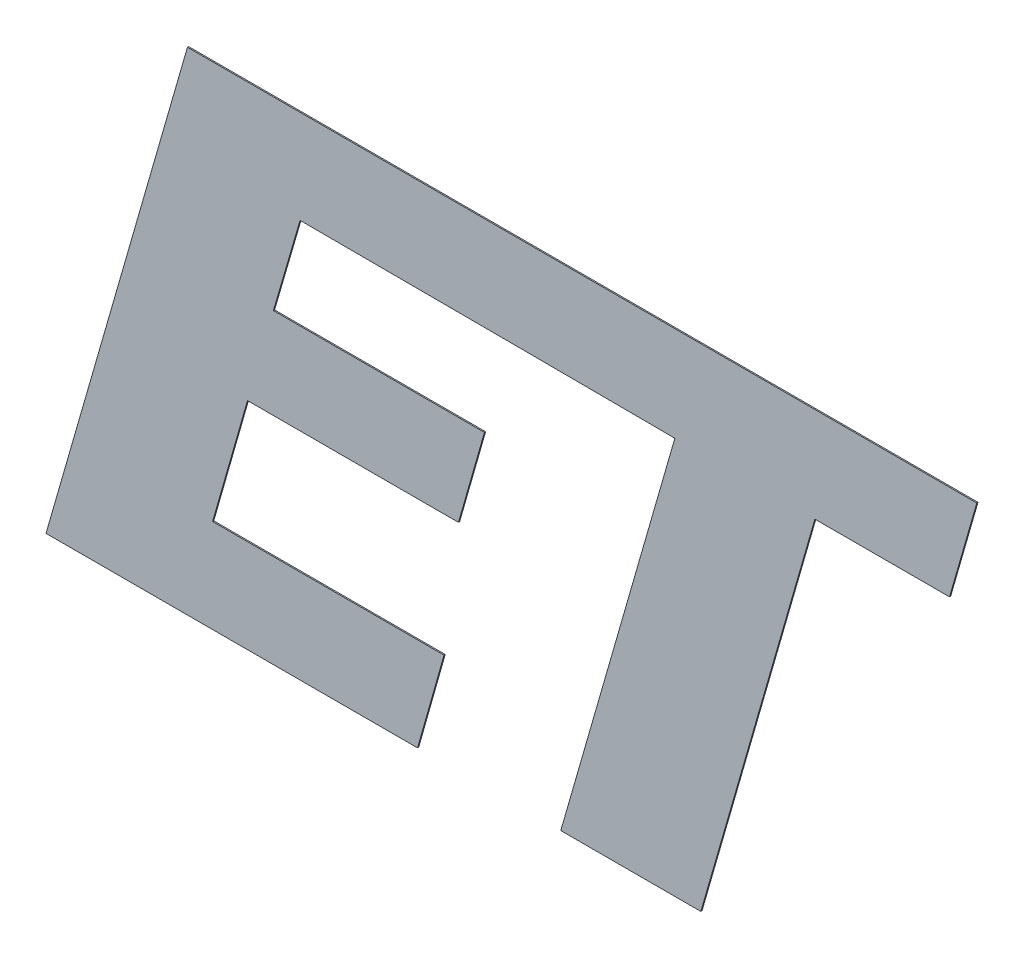
ISO-10303-21;
HEADER;
FILE_DESCRIPTION(('STEP AP214'),'2;1');
FILE_NAME('part.step','',(''),(''),'','','');
FILE_SCHEMA(('AUTOMOTIVE_DESIGN { 1 0 10303 214 1 1 1 1 }'));
ENDSEC;
DATA;
#1=APPLICATION_CONTEXT('core data for automotive mechanical design processes');
#2=APPLICATION_PROTOCOL_DEFINITION('international standard','automotive_design',2000,#1);
#3=PRODUCT_CONTEXT('',#1,'mechanical');
#4=PRODUCT('Part','Part','',(#3));
#5=PRODUCT_RELATED_PRODUCT_CATEGORY('part','',(#4));
#6=PRODUCT_DEFINITION_FORMATION('','',#4);
#7=PRODUCT_DEFINITION_CONTEXT('part definition',#1,'design');
#8=PRODUCT_DEFINITION('design','',#6,#7);
#9=PRODUCT_DEFINITION_SHAPE('','',#8);
#10=(LENGTH_UNIT() NAMED_UNIT(*) SI_UNIT(.MILLI.,.METRE.));
#11=(NAMED_UNIT(*) PLANE_ANGLE_UNIT() SI_UNIT($,.RADIAN.));
#12=(NAMED_UNIT(*) SI_UNIT($,.STERADIAN.) SOLID_ANGLE_UNIT());
#13=UNCERTAINTY_MEASURE_WITH_UNIT(LENGTH_MEASURE(1.E-05),#10,'distance_accuracy_value','');
#14=(GEOMETRIC_REPRESENTATION_CONTEXT(3) GLOBAL_UNCERTAINTY_ASSIGNED_CONTEXT((#13)) GLOBAL_UNIT_ASSIGNED_CONTEXT((#10,
#11,#12)) REPRESENTATION_CONTEXT('',''));
#15=CARTESIAN_POINT('',(0.,0.,0.));
#16=DIRECTION('',(0.,0.,1.));
#17=DIRECTION('',(1.,0.,0.));
#18=AXIS2_PLACEMENT_3D('',#15,#16,#17);
#19=CARTESIAN_POINT('',(11.563212908811,6.43585562533324,5.205));
#20=DIRECTION('',(0.00281330167602132,0.99999604265901,0.));
#21=DIRECTION('',(0.,0.,-1.));
#22=AXIS2_PLACEMENT_3D('',#19,#20,#21);
#23=PLANE('',#22);
#24=DIRECTION('',(0.99999604265901,-0.00281330167602132,0.));
#25=VECTOR('',#24,1.);
#26=CARTESIAN_POINT('',(11.563212908811,6.43585562533324,5.2));
#27=LINE('',#26,#25);
#28=CARTESIAN_POINT('',(11.563212908811,6.43585562533324,5.2));
#29=VERTEX_POINT('',#28);
#30=CARTESIAN_POINT('',(12.5025242320755,6.43321304875561,5.2));
#31=VERTEX_POINT('',#30);
#32=EDGE_CURVE('E10',#29,#31,#27,.T.);
#33=ORIENTED_EDGE('',*,*,#32,.T.);
#34=DIRECTION('',(0.,0.,-1.));
#35=VECTOR('',#34,1.);
#36=CARTESIAN_POINT('',(12.5025242320755,6.43321304875561,5.205));
#37=LINE('',#36,#35);
#38=CARTESIAN_POINT('',(12.5025242320755,6.43321304875561,5.205));
#39=VERTEX_POINT('',#38);
#40=EDGE_CURVE('E42',#39,#31,#37,.T.);
#41=ORIENTED_EDGE('',*,*,#40,.F.);
#42=DIRECTION('',(0.99999604265901,-0.00281330167602132,0.));
#43=VECTOR('',#42,1.);
#44=CARTESIAN_POINT('',(11.563212908811,6.43585562533324,5.205));
#45=LINE('',#44,#43);
#46=CARTESIAN_POINT('',(11.563212908811,6.43585562533324,5.205));
#47=VERTEX_POINT('',#46);
#48=EDGE_CURVE('E225',#47,#39,#45,.T.);
#49=ORIENTED_EDGE('',*,*,#48,.F.);
#50=DIRECTION('',(0.,0.,-1.));
#51=VECTOR('',#50,1.);
#52=CARTESIAN_POINT('',(11.563212908811,6.43585562533324,5.205));
#53=LINE('',#52,#51);
#54=EDGE_CURVE('E27',#47,#29,#53,.T.);
#55=ORIENTED_EDGE('',*,*,#54,.T.);
#56=EDGE_LOOP('',(#33,#41,#49,#55));
#57=FACE_BOUND('',#56,.T.);
#58=ADVANCED_FACE('F16',(#57),#23,.F.);
#59=CARTESIAN_POINT('',(12.5025242320755,6.43321304875561,5.205));
#60=DIRECTION('',(0.00465069382367867,0.999989185465002,0.));
#61=DIRECTION('',(0.,0.,-1.));
#62=AXIS2_PLACEMENT_3D('',#59,#60,#61);
#63=PLANE('',#62);
#64=DIRECTION('',(0.999989185465002,-0.00465069382367867,0.));
#65=VECTOR('',#64,1.);
#66=CARTESIAN_POINT('',(12.5025242320755,6.43321304875561,5.2));
#67=LINE('',#66,#65);
#68=CARTESIAN_POINT('',(13.1256737048785,6.43031494000952,5.2));
#69=VERTEX_POINT('',#68);
#70=EDGE_CURVE('E270',#31,#69,#67,.T.);
#71=ORIENTED_EDGE('',*,*,#70,.T.);
#72=DIRECTION('',(0.,0.,-1.));
#73=VECTOR('',#72,1.);
#74=CARTESIAN_POINT('',(13.1256737048785,6.43031494000952,5.205));
#75=LINE('',#74,#73);
#76=CARTESIAN_POINT('',(13.1256737048785,6.43031494000952,5.205));
#77=VERTEX_POINT('',#76);
#78=EDGE_CURVE('E236',#77,#69,#75,.T.);
#79=ORIENTED_EDGE('',*,*,#78,.F.);
#80=DIRECTION('',(0.999989185465002,-0.00465069382367867,0.));
#81=VECTOR('',#80,1.);
#82=CARTESIAN_POINT('',(12.5025242320755,6.43321304875561,5.205));
#83=LINE('',#82,#81);
#84=EDGE_CURVE('E222',#39,#77,#83,.T.);
#85=ORIENTED_EDGE('',*,*,#84,.F.);
#86=ORIENTED_EDGE('',*,*,#40,.T.);
#87=EDGE_LOOP('',(#71,#79,#85,#86));
#88=FACE_BOUND('',#87,.T.);
#89=ADVANCED_FACE('F543',(#88),#63,.F.);
#90=CARTESIAN_POINT('',(13.1256737048785,6.43031494000952,5.205));
#91=DIRECTION('',(0.961066454899901,-0.276317334356962,0.));
#92=DIRECTION('',(0.,0.,-1.));
#93=AXIS2_PLACEMENT_3D('',#90,#91,#92);
#94=PLANE('',#93);
#95=DIRECTION('',(-0.276317334356962,-0.961066454899901,0.));
#96=VECTOR('',#95,1.);
#97=CARTESIAN_POINT('',(13.1256737048785,6.43031494000952,5.2));
#98=LINE('',#97,#96);
#99=CARTESIAN_POINT('',(12.6501345708676,4.77632999999994,5.2));
#100=VERTEX_POINT('',#99);
#101=EDGE_CURVE('E240',#69,#100,#98,.T.);
#102=ORIENTED_EDGE('',*,*,#101,.T.);
#103=DIRECTION('',(0.,0.,-1.));
#104=VECTOR('',#103,1.);
#105=CARTESIAN_POINT('',(12.6501345708676,4.77632999999994,5.205));
#106=LINE('',#105,#104);
#107=CARTESIAN_POINT('',(12.6501345708676,4.77632999999994,5.205));
#108=VERTEX_POINT('',#107);
#109=EDGE_CURVE('E249',#108,#100,#106,.T.);
#110=ORIENTED_EDGE('',*,*,#109,.F.);
#111=DIRECTION('',(-0.276317334356962,-0.961066454899901,0.));
#112=VECTOR('',#111,1.);
#113=CARTESIAN_POINT('',(13.1256737048785,6.43031494000952,5.205));
#114=LINE('',#113,#112);
#115=EDGE_CURVE('E211',#77,#108,#114,.T.);
#116=ORIENTED_EDGE('',*,*,#115,.F.);
#117=ORIENTED_EDGE('',*,*,#78,.T.);
#118=EDGE_LOOP('',(#102,#110,#116,#117));
#119=FACE_BOUND('',#118,.T.);
#120=ADVANCED_FACE('F547',(#119),#94,.F.);
#121=CARTESIAN_POINT('',(12.6501345708676,4.77632999999994,5.205));
#122=DIRECTION('',(0.,1.,0.));
#123=DIRECTION('',(1.,0.,0.));
#124=AXIS2_PLACEMENT_3D('',#121,#122,#123);
#125=PLANE('',#124);
#126=DIRECTION('',(1.,0.,0.));
#127=VECTOR('',#126,1.);
#128=CARTESIAN_POINT('',(12.6501345708676,4.77632999999994,5.2));
#129=LINE('',#128,#127);
#130=CARTESIAN_POINT('',(13.2340318095169,4.77632999999994,5.2));
#131=VERTEX_POINT('',#130);
#132=EDGE_CURVE('E241',#100,#131,#129,.T.);
#133=ORIENTED_EDGE('',*,*,#132,.T.);
#134=DIRECTION('',(0.,0.,-1.));
#135=VECTOR('',#134,1.);
#136=CARTESIAN_POINT('',(13.2340318095169,4.77632999999994,5.205));
#137=LINE('',#136,#135);
#138=CARTESIAN_POINT('',(13.2340318095169,4.77632999999994,5.205));
#139=VERTEX_POINT('',#138);
#140=EDGE_CURVE('E254',#139,#131,#137,.T.);
#141=ORIENTED_EDGE('',*,*,#140,.F.);
#142=DIRECTION('',(1.,0.,0.));
#143=VECTOR('',#142,1.);
#144=CARTESIAN_POINT('',(12.6501345708676,4.77632999999994,5.205));
#145=LINE('',#144,#143);
#146=EDGE_CURVE('E208',#108,#139,#145,.T.);
#147=ORIENTED_EDGE('',*,*,#146,.F.);
#148=ORIENTED_EDGE('',*,*,#109,.T.);
#149=EDGE_LOOP('',(#133,#141,#147,#148));
#150=FACE_BOUND('',#149,.T.);
#151=ADVANCED_FACE('F550',(#150),#125,.F.);
#152=CARTESIAN_POINT('',(13.2340318095169,4.77632999999994,5.205));
#153=DIRECTION('',(-0.961087610217285,0.276243742891722,0.));
#154=DIRECTION('',(0.,0.,1.));
#155=AXIS2_PLACEMENT_3D('',#152,#153,#154);
#156=PLANE('',#155);
#157=DIRECTION('',(0.276243742891722,0.961087610217285,0.));
#158=VECTOR('',#157,1.);
#159=CARTESIAN_POINT('',(13.2340318095169,4.77632999999994,5.2));
#160=LINE('',#159,#158);
#161=CARTESIAN_POINT('',(13.7094338287044,6.43031494000443,5.2));
#162=VERTEX_POINT('',#161);
#163=EDGE_CURVE('E253',#131,#162,#160,.T.);
#164=ORIENTED_EDGE('',*,*,#163,.T.);
#165=DIRECTION('',(0.,0.,-1.));
#166=VECTOR('',#165,1.);
#167=CARTESIAN_POINT('',(13.7094338287044,6.43031494000443,5.205));
#168=LINE('',#167,#166);
#169=CARTESIAN_POINT('',(13.7094338287044,6.43031494000443,5.205));
#170=VERTEX_POINT('',#169);
#171=EDGE_CURVE('E231',#170,#162,#168,.T.);
#172=ORIENTED_EDGE('',*,*,#171,.F.);
#173=DIRECTION('',(0.276243742891722,0.961087610217285,0.));
#174=VECTOR('',#173,1.);
#175=CARTESIAN_POINT('',(13.2340318095169,4.77632999999994,5.205));
#176=LINE('',#175,#174);
#177=EDGE_CURVE('E212',#139,#170,#176,.T.);
#178=ORIENTED_EDGE('',*,*,#177,.F.);
#179=ORIENTED_EDGE('',*,*,#140,.T.);
#180=EDGE_LOOP('',(#164,#172,#178,#179));
#181=FACE_BOUND('',#180,.T.);
#182=ADVANCED_FACE('F556',(#181),#156,.F.);
#183=CARTESIAN_POINT('',(13.7094338287044,6.43031494000443,5.205));
#184=DIRECTION('',(7.938847109814E-05,0.999999996848735,0.));
#185=DIRECTION('',(0.,0.,-1.));
#186=AXIS2_PLACEMENT_3D('',#183,#184,#185);
#187=PLANE('',#186);
#188=DIRECTION('',(0.999999996848735,-7.93884710981399E-05,0.));
#189=VECTOR('',#188,1.);
#190=CARTESIAN_POINT('',(13.7094338287044,6.43031494000443,5.2));
#191=LINE('',#190,#189);
#192=CARTESIAN_POINT('',(14.2706376699915,6.43027038688935,5.2));
#193=VERTEX_POINT('',#192);
#194=EDGE_CURVE('E20',#162,#193,#191,.T.);
#195=ORIENTED_EDGE('',*,*,#194,.T.);
#196=DIRECTION('',(0.,0.,-1.));
#197=VECTOR('',#196,1.);
#198=CARTESIAN_POINT('',(14.2706376699915,6.43027038688935,5.205));
#199=LINE('',#198,#197);
#200=CARTESIAN_POINT('',(14.2706376699915,6.43027038688935,5.205));
#201=VERTEX_POINT('',#200);
#202=EDGE_CURVE('E326',#201,#193,#199,.T.);
#203=ORIENTED_EDGE('',*,*,#202,.F.);
#204=DIRECTION('',(0.999999996848735,-7.93884710981399E-05,0.));
#205=VECTOR('',#204,1.);
#206=CARTESIAN_POINT('',(13.7094338287044,6.43031494000443,5.205));
#207=LINE('',#206,#205);
#208=EDGE_CURVE('E214',#170,#201,#207,.T.);
#209=ORIENTED_EDGE('',*,*,#208,.F.);
#210=ORIENTED_EDGE('',*,*,#171,.T.);
#211=EDGE_LOOP('',(#195,#203,#209,#210));
#212=FACE_BOUND('',#211,.T.);
#213=ADVANCED_FACE('F559',(#212),#187,.F.);
#214=CARTESIAN_POINT('',(14.2706376699915,6.43027038688935,5.205));
#215=DIRECTION('',(-0.961099233430489,0.276203301029018,0.));
#216=DIRECTION('',(0.,0.,1.));
#217=AXIS2_PLACEMENT_3D('',#214,#215,#216);
#218=PLANE('',#217);
#219=DIRECTION('',(0.276203301029018,0.961099233430489,0.));
#220=VECTOR('',#219,1.);
#221=CARTESIAN_POINT('',(14.2706376699915,6.43027038688935,5.2));
#222=LINE('',#221,#220);
#223=CARTESIAN_POINT('',(14.3843877760506,6.82608440985244,5.2));
#224=VERTEX_POINT('',#223);
#225=EDGE_CURVE('E234',#193,#224,#222,.T.);
#226=ORIENTED_EDGE('',*,*,#225,.T.);
#227=DIRECTION('',(0.,0.,-1.));
#228=VECTOR('',#227,1.);
#229=CARTESIAN_POINT('',(14.3843877760506,6.82608440985244,5.205));
#230=LINE('',#229,#228);
#231=CARTESIAN_POINT('',(14.3843877760506,6.82608440985244,5.205));
#232=VERTEX_POINT('',#231);
#233=EDGE_CURVE('E296',#232,#224,#230,.T.);
#234=ORIENTED_EDGE('',*,*,#233,.F.);
#235=DIRECTION('',(0.276203301029018,0.961099233430489,0.));
#236=VECTOR('',#235,1.);
#237=CARTESIAN_POINT('',(14.2706376699915,6.43027038688935,5.205));
#238=LINE('',#237,#236);
#239=EDGE_CURVE('E245',#201,#232,#238,.T.);
#240=ORIENTED_EDGE('',*,*,#239,.F.);
#241=ORIENTED_EDGE('',*,*,#202,.T.);
#242=EDGE_LOOP('',(#226,#234,#240,#241));
#243=FACE_BOUND('',#242,.T.);
#244=ADVANCED_FACE('F352',(#243),#218,.F.);
#245=CARTESIAN_POINT('',(12.6155317773363,6.82608440985244,5.205));
#246=DIRECTION('',(0.,-1.,0.));
#247=DIRECTION('',(0.,0.,-1.));
#248=AXIS2_PLACEMENT_3D('',#245,#246,#247);
#249=PLANE('',#248);
#250=DIRECTION('',(-1.,0.,0.));
#251=VECTOR('',#250,1.);
#252=CARTESIAN_POINT('',(12.6155317773363,6.82608440985244,5.2));
#253=LINE('',#252,#251);
#254=CARTESIAN_POINT('',(11.0938813384048,6.82608440985244,5.2));
#255=VERTEX_POINT('',#254);
#256=EDGE_CURVE('E330',#224,#255,#253,.T.);
#257=ORIENTED_EDGE('',*,*,#256,.T.);
#258=DIRECTION('',(0.,0.,-1.));
#259=VECTOR('',#258,1.);
#260=CARTESIAN_POINT('',(11.0938813384048,6.82608440985244,5.205));
#261=LINE('',#260,#259);
#262=CARTESIAN_POINT('',(11.0938813384048,6.82608440985244,5.205));
#263=VERTEX_POINT('',#262);
#264=EDGE_CURVE('E226',#263,#255,#261,.T.);
#265=ORIENTED_EDGE('',*,*,#264,.F.);
#266=DIRECTION('',(-1.,0.,0.));
#267=VECTOR('',#266,1.);
#268=CARTESIAN_POINT('',(14.3843877760506,6.82608440985244,5.205));
#269=LINE('',#268,#267);
#270=EDGE_CURVE('E248',#232,#263,#269,.T.);
#271=ORIENTED_EDGE('',*,*,#270,.F.);
#272=ORIENTED_EDGE('',*,*,#233,.T.);
#273=EDGE_LOOP('',(#257,#265,#271,#272));
#274=FACE_BOUND('',#273,.T.);
#275=ADVANCED_FACE('F347',(#274),#249,.F.);
#276=CARTESIAN_POINT('',(11.0938813384048,6.82608440985244,5.205));
#277=DIRECTION('',(0.961034823670664,-0.276427328048977,0.));
#278=DIRECTION('',(0.,0.,-1.));
#279=AXIS2_PLACEMENT_3D('',#276,#277,#278);
#280=PLANE('',#279);
#281=DIRECTION('',(-0.276427328048977,-0.961034823670664,0.));
#282=VECTOR('',#281,1.);
#283=CARTESIAN_POINT('',(11.0938813384048,6.82608440985244,5.2));
#284=LINE('',#283,#282);
#285=CARTESIAN_POINT('',(10.5043000654724,4.77632999999994,5.2));
#286=VERTEX_POINT('',#285);
#287=EDGE_CURVE('E229',#255,#286,#284,.T.);
#288=ORIENTED_EDGE('',*,*,#287,.T.);
#289=DIRECTION('',(0.,0.,-1.));
#290=VECTOR('',#289,1.);
#291=CARTESIAN_POINT('',(10.5043000654724,4.77632999999994,5.205));
#292=LINE('',#291,#290);
#293=CARTESIAN_POINT('',(10.5043000654724,4.77632999999994,5.205));
#294=VERTEX_POINT('',#293);
#295=EDGE_CURVE('E188',#294,#286,#292,.T.);
#296=ORIENTED_EDGE('',*,*,#295,.F.);
#297=DIRECTION('',(-0.276427328048977,-0.961034823670664,0.));
#298=VECTOR('',#297,1.);
#299=CARTESIAN_POINT('',(11.0938813384048,6.82608440985244,5.205));
#300=LINE('',#299,#298);
#301=EDGE_CURVE('E203',#263,#294,#300,.T.);
#302=ORIENTED_EDGE('',*,*,#301,.F.);
#303=ORIENTED_EDGE('',*,*,#264,.T.);
#304=EDGE_LOOP('',(#288,#296,#302,#303));
#305=FACE_BOUND('',#304,.T.);
#306=ADVANCED_FACE('F18',(#305),#280,.F.);
#307=CARTESIAN_POINT('',(10.5043000654724,4.77632999999994,5.205));
#308=DIRECTION('',(0.,1.,0.));
#309=DIRECTION('',(1.,0.,0.));
#310=AXIS2_PLACEMENT_3D('',#307,#308,#309);
#311=PLANE('',#310);
#312=DIRECTION('',(1.,0.,0.));
#313=VECTOR('',#312,1.);
#314=CARTESIAN_POINT('',(10.5043000654724,4.77632999999994,5.2));
#315=LINE('',#314,#313);
#316=CARTESIAN_POINT('',(12.0529496594305,4.77632999999994,5.2));
#317=VERTEX_POINT('',#316);
#318=EDGE_CURVE('E230',#286,#317,#315,.T.);
#319=ORIENTED_EDGE('',*,*,#318,.T.);
#320=DIRECTION('',(0.,0.,-1.));
#321=VECTOR('',#320,1.);
#322=CARTESIAN_POINT('',(12.0529496594305,4.77632999999994,5.205));
#323=LINE('',#322,#321);
#324=CARTESIAN_POINT('',(12.0529496594305,4.77632999999994,5.205));
#325=VERTEX_POINT('',#324);
#326=EDGE_CURVE('E183',#325,#317,#323,.T.);
#327=ORIENTED_EDGE('',*,*,#326,.F.);
#328=DIRECTION('',(1.,0.,0.));
#329=VECTOR('',#328,1.);
#330=CARTESIAN_POINT('',(10.5043000654724,4.77632999999994,5.205));
#331=LINE('',#330,#329);
#332=EDGE_CURVE('E242',#294,#325,#331,.T.);
#333=ORIENTED_EDGE('',*,*,#332,.F.);
#334=ORIENTED_EDGE('',*,*,#295,.T.);
#335=EDGE_LOOP('',(#319,#327,#333,#334));
#336=FACE_BOUND('',#335,.T.);
#337=ADVANCED_FACE('F618',(#336),#311,.F.);
#338=CARTESIAN_POINT('',(12.0529496594305,4.77632999999994,5.205));
#339=DIRECTION('',(-0.962020079379883,0.272978693069485,0.));
#340=DIRECTION('',(0.,0.,1.));
#341=AXIS2_PLACEMENT_3D('',#338,#339,#340);
#342=PLANE('',#341);
#343=DIRECTION('',(0.272978693069485,0.962020079379883,0.));
#344=VECTOR('',#343,1.);
#345=CARTESIAN_POINT('',(12.0529496594305,4.77632999999994,5.2));
#346=LINE('',#345,#344);
#347=CARTESIAN_POINT('',(12.1636262510655,5.16637180975795,5.2));
#348=VERTEX_POINT('',#347);
#349=EDGE_CURVE('E180',#317,#348,#346,.T.);
#350=ORIENTED_EDGE('',*,*,#349,.T.);
#351=DIRECTION('',(0.,0.,-1.));
#352=VECTOR('',#351,1.);
#353=CARTESIAN_POINT('',(12.1636262510655,5.16637180975795,5.205));
#354=LINE('',#353,#352);
#355=CARTESIAN_POINT('',(12.1636262510655,5.16637180975795,5.205));
#356=VERTEX_POINT('',#355);
#357=EDGE_CURVE('E166',#356,#348,#354,.T.);
#358=ORIENTED_EDGE('',*,*,#357,.F.);
#359=DIRECTION('',(0.272978693069485,0.962020079379883,0.));
#360=VECTOR('',#359,1.);
#361=CARTESIAN_POINT('',(12.0529496594305,4.77632999999994,5.205));
#362=LINE('',#361,#360);
#363=EDGE_CURVE('E221',#325,#356,#362,.T.);
#364=ORIENTED_EDGE('',*,*,#363,.F.);
#365=ORIENTED_EDGE('',*,*,#326,.T.);
#366=EDGE_LOOP('',(#350,#358,#364,#365));
#367=FACE_BOUND('',#366,.T.);
#368=ADVANCED_FACE('F181',(#367),#342,.F.);
#369=CARTESIAN_POINT('',(12.1636262510655,5.16637180975795,5.205));
#370=DIRECTION('',(0.,-1.,0.));
#371=DIRECTION('',(0.,0.,-1.));
#372=AXIS2_PLACEMENT_3D('',#369,#370,#371);
#373=PLANE('',#372);
#374=DIRECTION('',(-1.,0.,0.));
#375=VECTOR('',#374,1.);
#376=CARTESIAN_POINT('',(12.1636262510655,5.16637180975795,5.2));
#377=LINE('',#376,#375);
#378=CARTESIAN_POINT('',(11.1987492459184,5.16637180975795,5.2));
#379=VERTEX_POINT('',#378);
#380=EDGE_CURVE('E171',#348,#379,#377,.T.);
#381=ORIENTED_EDGE('',*,*,#380,.T.);
#382=DIRECTION('',(0.,0.,-1.));
#383=VECTOR('',#382,1.);
#384=CARTESIAN_POINT('',(11.1987492459184,5.16637180975795,5.205));
#385=LINE('',#384,#383);
#386=CARTESIAN_POINT('',(11.1987492459184,5.16637180975795,5.205));
#387=VERTEX_POINT('',#386);
#388=EDGE_CURVE('E207',#387,#379,#385,.T.);
#389=ORIENTED_EDGE('',*,*,#388,.F.);
#390=DIRECTION('',(-1.,0.,0.));
#391=VECTOR('',#390,1.);
#392=CARTESIAN_POINT('',(12.1636262510655,5.16637180975795,5.205));
#393=LINE('',#392,#391);
#394=EDGE_CURVE('E173',#356,#387,#393,.T.);
#395=ORIENTED_EDGE('',*,*,#394,.F.);
#396=ORIENTED_EDGE('',*,*,#357,.T.);
#397=EDGE_LOOP('',(#381,#389,#395,#396));
#398=FACE_BOUND('',#397,.T.);
#399=ADVANCED_FACE('F168',(#398),#373,.F.);
#400=CARTESIAN_POINT('',(11.1987492459184,5.16637180975795,5.205));
#401=DIRECTION('',(-0.961582531986915,0.274515999857263,0.));
#402=DIRECTION('',(0.,0.,1.));
#403=AXIS2_PLACEMENT_3D('',#400,#401,#402);
#404=PLANE('',#403);
#405=DIRECTION('',(0.274515999857263,0.961582531986915,0.));
#406=VECTOR('',#405,1.);
#407=CARTESIAN_POINT('',(11.1987492459184,5.16637180975795,5.2));
#408=LINE('',#407,#406);
#409=CARTESIAN_POINT('',(11.3441657475534,5.67574090994719,5.2));
#410=VERTEX_POINT('',#409);
#411=EDGE_CURVE('E177',#379,#410,#408,.T.);
#412=ORIENTED_EDGE('',*,*,#411,.T.);
#413=DIRECTION('',(0.,0.,-1.));
#414=VECTOR('',#413,1.);
#415=CARTESIAN_POINT('',(11.3441657475534,5.67574090994719,5.205));
#416=LINE('',#415,#414);
#417=CARTESIAN_POINT('',(11.3441657475534,5.67574090994719,5.205));
#418=VERTEX_POINT('',#417);
#419=EDGE_CURVE('E153',#418,#410,#416,.T.);
#420=ORIENTED_EDGE('',*,*,#419,.F.);
#421=DIRECTION('',(0.274515999857263,0.961582531986915,0.));
#422=VECTOR('',#421,1.);
#423=CARTESIAN_POINT('',(11.1987492459184,5.16637180975795,5.205));
#424=LINE('',#423,#422);
#425=EDGE_CURVE('E142',#387,#418,#424,.T.);
#426=ORIENTED_EDGE('',*,*,#425,.F.);
#427=ORIENTED_EDGE('',*,*,#388,.T.);
#428=EDGE_LOOP('',(#412,#420,#426,#427));
#429=FACE_BOUND('',#428,.T.);
#430=ADVANCED_FACE('F524',(#429),#404,.F.);
#431=CARTESIAN_POINT('',(11.3441657475534,5.67574090994719,5.205));
#432=DIRECTION('',(0.,1.,0.));
#433=DIRECTION('',(1.,0.,0.));
#434=AXIS2_PLACEMENT_3D('',#431,#432,#433);
#435=PLANE('',#434);
#436=DIRECTION('',(1.,0.,0.));
#437=VECTOR('',#436,1.);
#438=CARTESIAN_POINT('',(11.3441657475534,5.67574090994719,5.2));
#439=LINE('',#438,#437);
#440=CARTESIAN_POINT('',(12.2236825432721,5.67574090994719,5.2));
#441=VERTEX_POINT('',#440);
#442=EDGE_CURVE('E205',#410,#441,#439,.T.);
#443=ORIENTED_EDGE('',*,*,#442,.T.);
#444=DIRECTION('',(0.,0.,-1.));
#445=VECTOR('',#444,1.);
#446=CARTESIAN_POINT('',(12.2236825432721,5.67574090994719,5.205));
#447=LINE('',#446,#445);
#448=CARTESIAN_POINT('',(12.2236825432721,5.67574090994719,5.205));
#449=VERTEX_POINT('',#448);
#450=EDGE_CURVE('E134',#449,#441,#447,.T.);
#451=ORIENTED_EDGE('',*,*,#450,.F.);
#452=DIRECTION('',(1.,0.,0.));
#453=VECTOR('',#452,1.);
#454=CARTESIAN_POINT('',(11.3441657475534,5.67574090994719,5.205));
#455=LINE('',#454,#453);
#456=EDGE_CURVE('E218',#418,#449,#455,.T.);
#457=ORIENTED_EDGE('',*,*,#456,.F.);
#458=ORIENTED_EDGE('',*,*,#419,.T.);
#459=EDGE_LOOP('',(#443,#451,#457,#458));
#460=FACE_BOUND('',#459,.T.);
#461=ADVANCED_FACE('F528',(#460),#435,.F.);
#462=CARTESIAN_POINT('',(12.2236825432721,5.67574090994719,5.205));
#463=DIRECTION('',(-0.961532303768429,0.274691879766727,0.));
#464=DIRECTION('',(0.,0.,1.));
#465=AXIS2_PLACEMENT_3D('',#462,#463,#464);
#466=PLANE('',#465);
#467=DIRECTION('',(0.274691879766727,0.961532303768429,0.));
#468=VECTOR('',#467,1.);
#469=CARTESIAN_POINT('',(12.2236825432721,5.67574090994719,5.2));
#470=LINE('',#469,#468);
#471=CARTESIAN_POINT('',(12.3319159980721,6.05460162919037,5.2));
#472=VERTEX_POINT('',#471);
#473=EDGE_CURVE('E526',#441,#472,#470,.T.);
#474=ORIENTED_EDGE('',*,*,#473,.T.);
#475=DIRECTION('',(0.,0.,-1.));
#476=VECTOR('',#475,1.);
#477=CARTESIAN_POINT('',(12.3319159980721,6.05460162919037,5.205));
#478=LINE('',#477,#476);
#479=CARTESIAN_POINT('',(12.3319159980721,6.05460162919037,5.205));
#480=VERTEX_POINT('',#479);
#481=EDGE_CURVE('E261',#480,#472,#478,.T.);
#482=ORIENTED_EDGE('',*,*,#481,.F.);
#483=DIRECTION('',(0.274691879766727,0.961532303768429,0.));
#484=VECTOR('',#483,1.);
#485=CARTESIAN_POINT('',(12.2236825432721,5.67574090994719,5.205));
#486=LINE('',#485,#484);
#487=EDGE_CURVE('E263',#449,#480,#486,.T.);
#488=ORIENTED_EDGE('',*,*,#487,.F.);
#489=ORIENTED_EDGE('',*,*,#450,.T.);
#490=EDGE_LOOP('',(#474,#482,#488,#489));
#491=FACE_BOUND('',#490,.T.);
#492=ADVANCED_FACE('F532',(#491),#466,.F.);
#493=CARTESIAN_POINT('',(12.3319159980721,6.05460162919037,5.205));
#494=DIRECTION('',(0.,-1.,0.));
#495=DIRECTION('',(0.,0.,-1.));
#496=AXIS2_PLACEMENT_3D('',#493,#494,#495);
#497=PLANE('',#496);
#498=DIRECTION('',(-1.,0.,0.));
#499=VECTOR('',#498,1.);
#500=CARTESIAN_POINT('',(12.3319159980721,6.05460162919037,5.2));
#501=LINE('',#500,#499);
#502=CARTESIAN_POINT('',(11.4522745525148,6.05460162919037,5.2));
#503=VERTEX_POINT('',#502);
#504=EDGE_CURVE('E309',#472,#503,#501,.T.);
#505=ORIENTED_EDGE('',*,*,#504,.T.);
#506=DIRECTION('',(0.,0.,-1.));
#507=VECTOR('',#506,1.);
#508=CARTESIAN_POINT('',(11.4522745525148,6.05460162919037,5.205));
#509=LINE('',#508,#507);
#510=CARTESIAN_POINT('',(11.4522745525148,6.05460162919037,5.205));
#511=VERTEX_POINT('',#510);
#512=EDGE_CURVE('E262',#511,#503,#509,.T.);
#513=ORIENTED_EDGE('',*,*,#512,.F.);
#514=DIRECTION('',(-1.,0.,0.));
#515=VECTOR('',#514,1.);
#516=CARTESIAN_POINT('',(12.3319159980721,6.05460162919037,5.205));
#517=LINE('',#516,#515);
#518=EDGE_CURVE('E266',#480,#511,#517,.T.);
#519=ORIENTED_EDGE('',*,*,#518,.F.);
#520=ORIENTED_EDGE('',*,*,#481,.T.);
#521=EDGE_LOOP('',(#505,#513,#519,#520));
#522=FACE_BOUND('',#521,.T.);
#523=ADVANCED_FACE('F536',(#522),#497,.F.);
#524=CARTESIAN_POINT('',(11.4522745525148,6.05460162919037,5.205));
#525=DIRECTION('',(-0.960176311434603,0.279394794081492,0.));
#526=DIRECTION('',(0.,0.,1.));
#527=AXIS2_PLACEMENT_3D('',#524,#525,#526);
#528=PLANE('',#527);
#529=DIRECTION('',(0.279394794081492,0.960176311434603,0.));
#530=VECTOR('',#529,1.);
#531=CARTESIAN_POINT('',(11.4522745525148,6.05460162919037,5.2));
#532=LINE('',#531,#530);
#533=EDGE_CURVE('E257',#503,#29,#532,.T.);
#534=ORIENTED_EDGE('',*,*,#533,.T.);
#535=ORIENTED_EDGE('',*,*,#54,.F.);
#536=DIRECTION('',(0.279394794081492,0.960176311434603,0.));
#537=VECTOR('',#536,1.);
#538=CARTESIAN_POINT('',(11.4522745525148,6.05460162919037,5.205));
#539=LINE('',#538,#537);
#540=EDGE_CURVE('E298',#511,#47,#539,.T.);
#541=ORIENTED_EDGE('',*,*,#540,.F.);
#542=ORIENTED_EDGE('',*,*,#512,.T.);
#543=EDGE_LOOP('',(#534,#535,#541,#542));
#544=FACE_BOUND('',#543,.T.);
#545=ADVANCED_FACE('F538',(#544),#528,.F.);
#546=CARTESIAN_POINT('',(-0.222484440430861,-1.85805867567166,5.205));
#547=DIRECTION('',(0.,0.,1.));
#548=DIRECTION('',(1.,0.,0.));
#549=AXIS2_PLACEMENT_3D('',#546,#547,#548);
#550=PLANE('',#549);
#551=ORIENTED_EDGE('',*,*,#48,.T.);
#552=ORIENTED_EDGE('',*,*,#84,.T.);
#553=ORIENTED_EDGE('',*,*,#115,.T.);
#554=ORIENTED_EDGE('',*,*,#146,.T.);
#555=ORIENTED_EDGE('',*,*,#177,.T.);
#556=ORIENTED_EDGE('',*,*,#208,.T.);
#557=ORIENTED_EDGE('',*,*,#239,.T.);
#558=ORIENTED_EDGE('',*,*,#270,.T.);
#559=ORIENTED_EDGE('',*,*,#301,.T.);
#560=ORIENTED_EDGE('',*,*,#332,.T.);
#561=ORIENTED_EDGE('',*,*,#363,.T.);
#562=ORIENTED_EDGE('',*,*,#394,.T.);
#563=ORIENTED_EDGE('',*,*,#425,.T.);
#564=ORIENTED_EDGE('',*,*,#456,.T.);
#565=ORIENTED_EDGE('',*,*,#487,.T.);
#566=ORIENTED_EDGE('',*,*,#518,.T.);
#567=ORIENTED_EDGE('',*,*,#540,.T.);
#568=EDGE_LOOP('',(#551,#552,#553,#554,#555,#556,#557,#558,#559,#560,#561,#562,#563,#564,#565,
#566,#567));
#569=FACE_BOUND('',#568,.T.);
#570=ADVANCED_FACE('F529',(#569),#550,.T.);
#571=CARTESIAN_POINT('',(-0.222484440430861,-1.85805867567166,5.2));
#572=DIRECTION('',(0.,0.,1.));
#573=DIRECTION('',(1.,0.,0.));
#574=AXIS2_PLACEMENT_3D('',#571,#572,#573);
#575=PLANE('',#574);
#576=ORIENTED_EDGE('',*,*,#32,.F.);
#577=ORIENTED_EDGE('',*,*,#533,.F.);
#578=ORIENTED_EDGE('',*,*,#504,.F.);
#579=ORIENTED_EDGE('',*,*,#473,.F.);
#580=ORIENTED_EDGE('',*,*,#442,.F.);
#581=ORIENTED_EDGE('',*,*,#411,.F.);
#582=ORIENTED_EDGE('',*,*,#380,.F.);
#583=ORIENTED_EDGE('',*,*,#349,.F.);
#584=ORIENTED_EDGE('',*,*,#318,.F.);
#585=ORIENTED_EDGE('',*,*,#287,.F.);
#586=ORIENTED_EDGE('',*,*,#256,.F.);
#587=ORIENTED_EDGE('',*,*,#225,.F.);
#588=ORIENTED_EDGE('',*,*,#194,.F.);
#589=ORIENTED_EDGE('',*,*,#163,.F.);
#590=ORIENTED_EDGE('',*,*,#132,.F.);
#591=ORIENTED_EDGE('',*,*,#101,.F.);
#592=ORIENTED_EDGE('',*,*,#70,.F.);
#593=EDGE_LOOP('',(#576,#577,#578,#579,#580,#581,#582,#583,#584,#585,#586,#587,#588,#589,#590,
#591,#592));
#594=FACE_BOUND('',#593,.T.);
#595=ADVANCED_FACE('F191',(#594),#575,.F.);
#596=CLOSED_SHELL('',(#58,#89,#120,#151,#182,#213,#244,#275,#306,#337,#368,#399,#430,#461,#492,
#523,#545,#570,#595));
#597=MANIFOLD_SOLID_BREP('B1',#596);
#598=ADVANCED_BREP_SHAPE_REPRESENTATION('',(#18,#597),#14);
#599=SHAPE_DEFINITION_REPRESENTATION(#9,#598);
ENDSEC;
END-ISO-10303-21;
